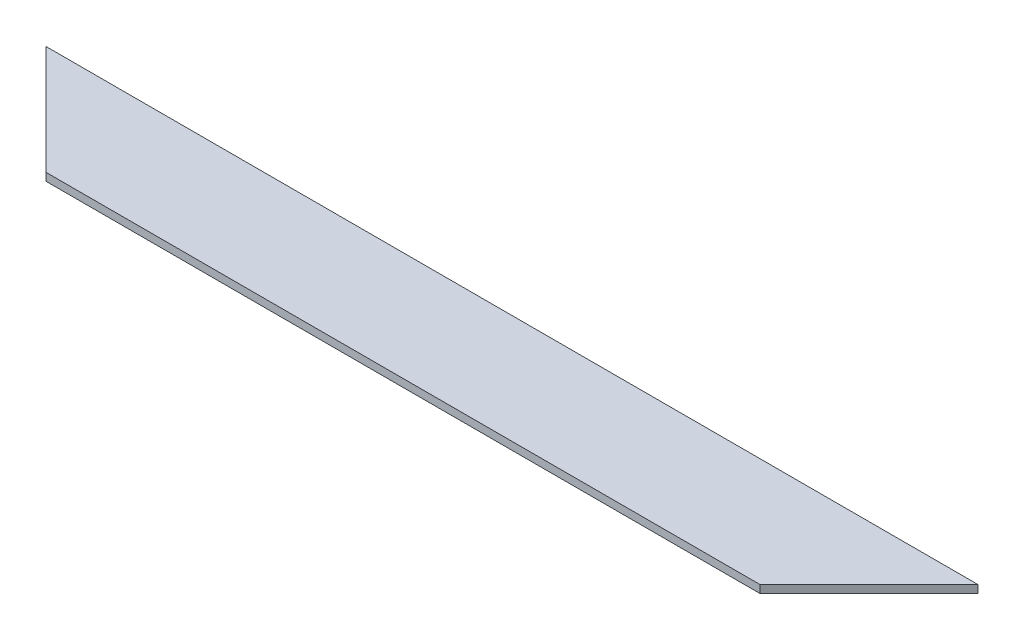
ISO-10303-21;
HEADER;
FILE_DESCRIPTION(('STEP AP214'),'2;1');
FILE_NAME('part.step','',(''),(''),'','','');
FILE_SCHEMA(('AUTOMOTIVE_DESIGN { 1 0 10303 214 1 1 1 1 }'));
ENDSEC;
DATA;
#1=APPLICATION_CONTEXT('core data for automotive mechanical design processes');
#2=APPLICATION_PROTOCOL_DEFINITION('international standard','automotive_design',2000,#1);
#3=PRODUCT_CONTEXT('',#1,'mechanical');
#4=PRODUCT('Part','Part','',(#3));
#5=PRODUCT_RELATED_PRODUCT_CATEGORY('part','',(#4));
#6=PRODUCT_DEFINITION_FORMATION('','',#4);
#7=PRODUCT_DEFINITION_CONTEXT('part definition',#1,'design');
#8=PRODUCT_DEFINITION('design','',#6,#7);
#9=PRODUCT_DEFINITION_SHAPE('','',#8);
#10=(LENGTH_UNIT() NAMED_UNIT(*) SI_UNIT(.MILLI.,.METRE.));
#11=(NAMED_UNIT(*) PLANE_ANGLE_UNIT() SI_UNIT($,.RADIAN.));
#12=(NAMED_UNIT(*) SI_UNIT($,.STERADIAN.) SOLID_ANGLE_UNIT());
#13=UNCERTAINTY_MEASURE_WITH_UNIT(LENGTH_MEASURE(1.E-05),#10,'distance_accuracy_value','');
#14=(GEOMETRIC_REPRESENTATION_CONTEXT(3) GLOBAL_UNCERTAINTY_ASSIGNED_CONTEXT((#13)) GLOBAL_UNIT_ASSIGNED_CONTEXT((#10,
#11,#12)) REPRESENTATION_CONTEXT('',''));
#15=CARTESIAN_POINT('',(0.,0.,0.));
#16=DIRECTION('',(0.,0.,1.));
#17=DIRECTION('',(1.,0.,0.));
#18=AXIS2_PLACEMENT_3D('',#15,#16,#17);
#19=CARTESIAN_POINT('',(-2.55813888590709E-13,6.35,88.8999999999988));
#20=DIRECTION('',(0.,0.,1.));
#21=DIRECTION('',(1.,0.,0.));
#22=AXIS2_PLACEMENT_3D('',#19,#20,#21);
#23=PLANE('',#22);
#24=DIRECTION('',(-1.,0.,0.));
#25=VECTOR('',#24,1.);
#26=CARTESIAN_POINT('',(-2.55813888590709E-13,0.,88.8999999999988));
#27=LINE('',#26,#25);
#28=CARTESIAN_POINT('',(291.197438789308,0.,88.8999999999997));
#29=VERTEX_POINT('',#28);
#30=CARTESIAN_POINT('',(-291.197438789308,-2.22044604925031E-13,88.8999999999999));
#31=VERTEX_POINT('',#30);
#32=EDGE_CURVE('E95',#29,#31,#27,.T.);
#33=ORIENTED_EDGE('',*,*,#32,.F.);
#34=DIRECTION('',(0.,1.,0.));
#35=VECTOR('',#34,1.);
#36=CARTESIAN_POINT('',(291.197438789308,-603.25,88.8999999999999));
#37=LINE('',#36,#35);
#38=CARTESIAN_POINT('',(291.197438789308,6.35,88.8999999999999));
#39=VERTEX_POINT('',#38);
#40=EDGE_CURVE('E47',#29,#39,#37,.T.);
#41=ORIENTED_EDGE('',*,*,#40,.T.);
#42=DIRECTION('',(-1.,0.,0.));
#43=VECTOR('',#42,1.);
#44=CARTESIAN_POINT('',(-2.55813888590709E-13,6.35,88.8999999999988));
#45=LINE('',#44,#43);
#46=CARTESIAN_POINT('',(-291.197438789308,6.35,88.8999999999999));
#47=VERTEX_POINT('',#46);
#48=EDGE_CURVE('E87',#39,#47,#45,.T.);
#49=ORIENTED_EDGE('',*,*,#48,.T.);
#50=DIRECTION('',(0.,1.,0.));
#51=VECTOR('',#50,1.);
#52=CARTESIAN_POINT('',(-291.197438789308,-603.25,88.8999999999999));
#53=LINE('',#52,#51);
#54=EDGE_CURVE('E103',#31,#47,#53,.T.);
#55=ORIENTED_EDGE('',*,*,#54,.F.);
#56=EDGE_LOOP('',(#33,#41,#49,#55));
#57=FACE_BOUND('',#56,.T.);
#58=ADVANCED_FACE('F34',(#57),#23,.T.);
#59=CARTESIAN_POINT('',(0.,6.35,0.));
#60=DIRECTION('',(0.,0.,-1.));
#61=DIRECTION('',(-1.,0.,0.));
#62=AXIS2_PLACEMENT_3D('',#59,#60,#61);
#63=PLANE('',#62);
#64=DIRECTION('',(1.,0.,0.));
#65=VECTOR('',#64,1.);
#66=CARTESIAN_POINT('',(0.,6.35,0.));
#67=LINE('',#66,#65);
#68=CARTESIAN_POINT('',(-380.097438789304,6.35,0.));
#69=VERTEX_POINT('',#68);
#70=CARTESIAN_POINT('',(380.097438789304,6.35,0.));
#71=VERTEX_POINT('',#70);
#72=EDGE_CURVE('E86',#69,#71,#67,.T.);
#73=ORIENTED_EDGE('',*,*,#72,.T.);
#74=DIRECTION('',(0.,1.,0.));
#75=VECTOR('',#74,1.);
#76=CARTESIAN_POINT('',(380.097438789304,-603.25,0.));
#77=LINE('',#76,#75);
#78=CARTESIAN_POINT('',(380.097438789304,-2.22044604925031E-13,0.));
#79=VERTEX_POINT('',#78);
#80=EDGE_CURVE('E72',#79,#71,#77,.T.);
#81=ORIENTED_EDGE('',*,*,#80,.F.);
#82=DIRECTION('',(1.,0.,0.));
#83=VECTOR('',#82,1.);
#84=CARTESIAN_POINT('',(0.,0.,0.));
#85=LINE('',#84,#83);
#86=CARTESIAN_POINT('',(-380.097438789305,0.,0.));
#87=VERTEX_POINT('',#86);
#88=EDGE_CURVE('E91',#87,#79,#85,.T.);
#89=ORIENTED_EDGE('',*,*,#88,.F.);
#90=DIRECTION('',(0.,1.,0.));
#91=VECTOR('',#90,1.);
#92=CARTESIAN_POINT('',(-380.097438789304,-603.25,0.));
#93=LINE('',#92,#91);
#94=EDGE_CURVE('E55',#87,#69,#93,.T.);
#95=ORIENTED_EDGE('',*,*,#94,.T.);
#96=EDGE_LOOP('',(#73,#81,#89,#95));
#97=FACE_BOUND('',#96,.T.);
#98=ADVANCED_FACE('F89',(#97),#63,.T.);
#99=CARTESIAN_POINT('',(0.,6.35,0.));
#100=DIRECTION('',(0.,1.,0.));
#101=DIRECTION('',(0.,0.,1.));
#102=AXIS2_PLACEMENT_3D('',#99,#100,#101);
#103=PLANE('',#102);
#104=ORIENTED_EDGE('',*,*,#48,.F.);
#105=DIRECTION('',(0.707106781186533,0.,-0.707106781186562));
#106=VECTOR('',#105,1.);
#107=CARTESIAN_POINT('',(380.097438789304,6.35,0.));
#108=LINE('',#107,#106);
#109=EDGE_CURVE('E75',#39,#71,#108,.T.);
#110=ORIENTED_EDGE('',*,*,#109,.T.);
#111=ORIENTED_EDGE('',*,*,#72,.F.);
#112=DIRECTION('',(-0.707106781186533,0.,-0.707106781186562));
#113=VECTOR('',#112,1.);
#114=CARTESIAN_POINT('',(-380.097438789304,6.35,0.));
#115=LINE('',#114,#113);
#116=EDGE_CURVE('E105',#47,#69,#115,.T.);
#117=ORIENTED_EDGE('',*,*,#116,.F.);
#118=EDGE_LOOP('',(#104,#110,#111,#117));
#119=FACE_BOUND('',#118,.T.);
#120=ADVANCED_FACE('F84',(#119),#103,.T.);
#121=CARTESIAN_POINT('',(0.,0.,0.));
#122=DIRECTION('',(0.,1.,0.));
#123=DIRECTION('',(0.,0.,1.));
#124=AXIS2_PLACEMENT_3D('',#121,#122,#123);
#125=PLANE('',#124);
#126=DIRECTION('',(0.707106781186533,0.,-0.707106781186562));
#127=VECTOR('',#126,1.);
#128=CARTESIAN_POINT('',(190.04871939466,0.,190.048719394652));
#129=LINE('',#128,#127);
#130=EDGE_CURVE('E11',#29,#79,#129,.T.);
#131=ORIENTED_EDGE('',*,*,#130,.F.);
#132=ORIENTED_EDGE('',*,*,#32,.T.);
#133=DIRECTION('',(-0.707106781186533,0.,-0.707106781186562));
#134=VECTOR('',#133,1.);
#135=CARTESIAN_POINT('',(-190.04871939466,0.,190.048719394652));
#136=LINE('',#135,#134);
#137=EDGE_CURVE('E41',#31,#87,#136,.T.);
#138=ORIENTED_EDGE('',*,*,#137,.T.);
#139=ORIENTED_EDGE('',*,*,#88,.T.);
#140=EDGE_LOOP('',(#131,#132,#138,#139));
#141=FACE_BOUND('',#140,.T.);
#142=ADVANCED_FACE('F98',(#141),#125,.F.);
#143=CARTESIAN_POINT('',(-380.097438789304,-603.25,0.));
#144=DIRECTION('',(0.707106781186562,0.,-0.707106781186533));
#145=DIRECTION('',(-0.707106781186533,0.,-0.707106781186562));
#146=AXIS2_PLACEMENT_3D('',#143,#144,#145);
#147=PLANE('',#146);
#148=ORIENTED_EDGE('',*,*,#54,.T.);
#149=ORIENTED_EDGE('',*,*,#116,.T.);
#150=ORIENTED_EDGE('',*,*,#94,.F.);
#151=ORIENTED_EDGE('',*,*,#137,.F.);
#152=EDGE_LOOP('',(#148,#149,#150,#151));
#153=FACE_BOUND('',#152,.T.);
#154=ADVANCED_FACE('F102',(#153),#147,.F.);
#155=CARTESIAN_POINT('',(380.097438789304,-603.25,0.));
#156=DIRECTION('',(0.707106781186562,0.,0.707106781186533));
#157=DIRECTION('',(0.707106781186533,0.,-0.707106781186562));
#158=AXIS2_PLACEMENT_3D('',#155,#156,#157);
#159=PLANE('',#158);
#160=ORIENTED_EDGE('',*,*,#130,.T.);
#161=ORIENTED_EDGE('',*,*,#80,.T.);
#162=ORIENTED_EDGE('',*,*,#109,.F.);
#163=ORIENTED_EDGE('',*,*,#40,.F.);
#164=EDGE_LOOP('',(#160,#161,#162,#163));
#165=FACE_BOUND('',#164,.T.);
#166=ADVANCED_FACE('F74',(#165),#159,.T.);
#167=CLOSED_SHELL('',(#58,#98,#120,#142,#154,#166));
#168=MANIFOLD_SOLID_BREP('B2',#167);
#169=ADVANCED_BREP_SHAPE_REPRESENTATION('',(#18,#168),#14);
#170=SHAPE_DEFINITION_REPRESENTATION(#9,#169);
ENDSEC;
END-ISO-10303-21;
